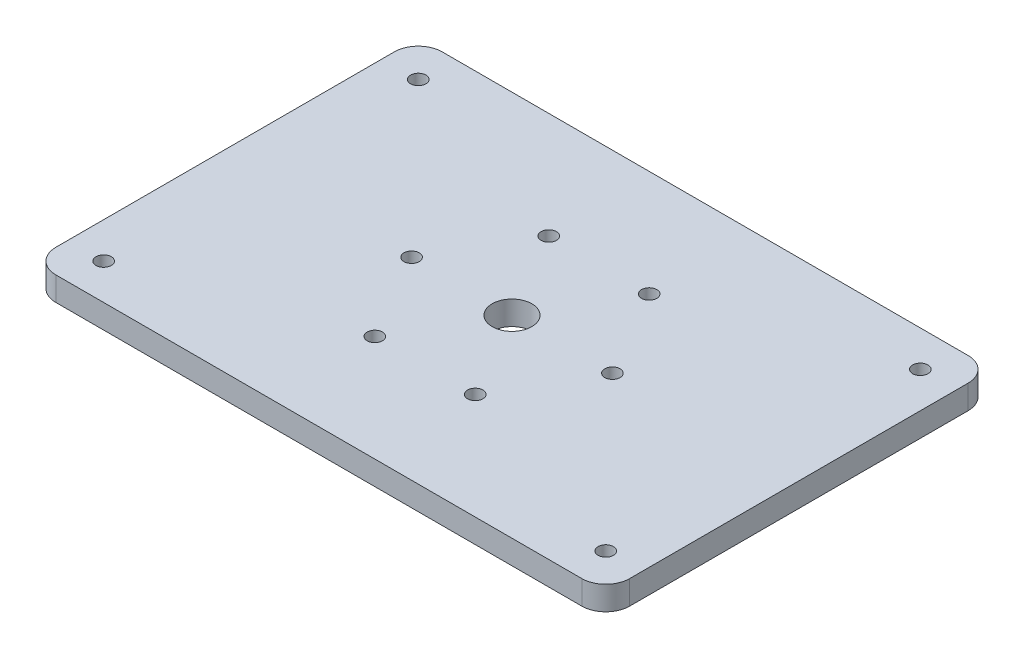
ISO-10303-21;
HEADER;
FILE_DESCRIPTION(('STEP AP214'),'2;1');
FILE_NAME('part.step','',(''),(''),'','','');
FILE_SCHEMA(('AUTOMOTIVE_DESIGN { 1 0 10303 214 1 1 1 1 }'));
ENDSEC;
DATA;
#1=APPLICATION_CONTEXT('core data for automotive mechanical design processes');
#2=APPLICATION_PROTOCOL_DEFINITION('international standard','automotive_design',2000,#1);
#3=PRODUCT_CONTEXT('',#1,'mechanical');
#4=PRODUCT('Part','Part','',(#3));
#5=PRODUCT_RELATED_PRODUCT_CATEGORY('part','',(#4));
#6=PRODUCT_DEFINITION_FORMATION('','',#4);
#7=PRODUCT_DEFINITION_CONTEXT('part definition',#1,'design');
#8=PRODUCT_DEFINITION('design','',#6,#7);
#9=PRODUCT_DEFINITION_SHAPE('','',#8);
#10=(LENGTH_UNIT() NAMED_UNIT(*) SI_UNIT(.MILLI.,.METRE.));
#11=(NAMED_UNIT(*) PLANE_ANGLE_UNIT() SI_UNIT($,.RADIAN.));
#12=(NAMED_UNIT(*) SI_UNIT($,.STERADIAN.) SOLID_ANGLE_UNIT());
#13=UNCERTAINTY_MEASURE_WITH_UNIT(LENGTH_MEASURE(1.E-05),#10,'distance_accuracy_value','');
#14=(GEOMETRIC_REPRESENTATION_CONTEXT(3) GLOBAL_UNCERTAINTY_ASSIGNED_CONTEXT((#13)) GLOBAL_UNIT_ASSIGNED_CONTEXT((#10,
#11,#12)) REPRESENTATION_CONTEXT('',''));
#15=CARTESIAN_POINT('',(0.,0.,0.));
#16=DIRECTION('',(0.,0.,1.));
#17=DIRECTION('',(1.,0.,0.));
#18=AXIS2_PLACEMENT_3D('',#15,#16,#17);
#19=CARTESIAN_POINT('',(0.,5.,0.));
#20=DIRECTION('',(0.,-1.,0.));
#21=DIRECTION('',(0.,0.,-1.));
#22=AXIS2_PLACEMENT_3D('',#19,#20,#21);
#23=PLANE('',#22);
#24=CARTESIAN_POINT('',(7.50000000000001,5.,-7.50000000000001));
#25=DIRECTION('',(0.,1.,0.));
#26=DIRECTION('',(0.,0.,1.));
#27=AXIS2_PLACEMENT_3D('',#24,#25,#26);
#28=CIRCLE('',#27,1.6);
#29=CARTESIAN_POINT('',(7.50000000000001,5.,-5.90000000000001));
#30=VERTEX_POINT('',#29);
#31=EDGE_CURVE('E225',#30,#30,#28,.T.);
#32=ORIENTED_EDGE('',*,*,#31,.F.);
#33=EDGE_LOOP('',(#32));
#34=FACE_BOUND('',#33,.T.);
#35=CARTESIAN_POINT('',(112.5,5.,-73.29));
#36=DIRECTION('',(0.,1.,0.));
#37=DIRECTION('',(0.,0.,-1.));
#38=AXIS2_PLACEMENT_3D('',#35,#36,#37);
#39=CIRCLE('',#38,1.60000000000001);
#40=CARTESIAN_POINT('',(112.5,5.,-74.89));
#41=VERTEX_POINT('',#40);
#42=EDGE_CURVE('E231',#41,#41,#39,.T.);
#43=ORIENTED_EDGE('',*,*,#42,.F.);
#44=EDGE_LOOP('',(#43));
#45=FACE_BOUND('',#44,.T.);
#46=CARTESIAN_POINT('',(112.5,5.,-7.50000000000002));
#47=DIRECTION('',(0.,1.,0.));
#48=DIRECTION('',(0.,0.,-1.));
#49=AXIS2_PLACEMENT_3D('',#46,#47,#48);
#50=CIRCLE('',#49,1.60000000000001);
#51=CARTESIAN_POINT('',(112.5,5.,-9.10000000000002));
#52=VERTEX_POINT('',#51);
#53=EDGE_CURVE('E232',#52,#52,#50,.T.);
#54=ORIENTED_EDGE('',*,*,#53,.F.);
#55=EDGE_LOOP('',(#54));
#56=FACE_BOUND('',#55,.T.);
#57=CARTESIAN_POINT('',(7.50000000000001,5.,-73.29));
#58=DIRECTION('',(0.,1.,0.));
#59=DIRECTION('',(0.,0.,1.));
#60=AXIS2_PLACEMENT_3D('',#57,#58,#59);
#61=CIRCLE('',#60,1.6);
#62=CARTESIAN_POINT('',(7.50000000000001,5.,-71.69));
#63=VERTEX_POINT('',#62);
#64=EDGE_CURVE('E222',#63,#63,#61,.T.);
#65=ORIENTED_EDGE('',*,*,#64,.F.);
#66=EDGE_LOOP('',(#65));
#67=FACE_BOUND('',#66,.T.);
#68=DIRECTION('',(0.,0.,-1.));
#69=VECTOR('',#68,1.);
#70=CARTESIAN_POINT('',(120.,5.,0.));
#71=LINE('',#70,#69);
#72=CARTESIAN_POINT('',(120.,5.,-5.));
#73=VERTEX_POINT('',#72);
#74=CARTESIAN_POINT('',(120.,5.,-75.79));
#75=VERTEX_POINT('',#74);
#76=EDGE_CURVE('E179',#73,#75,#71,.T.);
#77=ORIENTED_EDGE('',*,*,#76,.T.);
#78=CARTESIAN_POINT('',(115.,5.,-75.79));
#79=DIRECTION('',(0.,-1.,0.));
#80=DIRECTION('',(0.,0.,-1.));
#81=AXIS2_PLACEMENT_3D('',#78,#79,#80);
#82=CIRCLE('',#81,5.);
#83=CARTESIAN_POINT('',(115.,5.,-80.79));
#84=VERTEX_POINT('',#83);
#85=EDGE_CURVE('E156',#75,#84,#82,.F.);
#86=ORIENTED_EDGE('',*,*,#85,.T.);
#87=DIRECTION('',(-1.,0.,0.));
#88=VECTOR('',#87,1.);
#89=CARTESIAN_POINT('',(0.,5.,-80.79));
#90=LINE('',#89,#88);
#91=CARTESIAN_POINT('',(5.,5.,-80.79));
#92=VERTEX_POINT('',#91);
#93=EDGE_CURVE('E127',#84,#92,#90,.T.);
#94=ORIENTED_EDGE('',*,*,#93,.T.);
#95=CARTESIAN_POINT('',(5.,5.,-75.79));
#96=DIRECTION('',(0.,-1.,0.));
#97=DIRECTION('',(0.,0.,-1.));
#98=AXIS2_PLACEMENT_3D('',#95,#96,#97);
#99=CIRCLE('',#98,5.);
#100=CARTESIAN_POINT('',(0.,5.,-75.79));
#101=VERTEX_POINT('',#100);
#102=EDGE_CURVE('E151',#92,#101,#99,.F.);
#103=ORIENTED_EDGE('',*,*,#102,.T.);
#104=DIRECTION('',(0.,0.,1.));
#105=VECTOR('',#104,1.);
#106=CARTESIAN_POINT('',(0.,5.,0.));
#107=LINE('',#106,#105);
#108=CARTESIAN_POINT('',(0.,5.,-5.));
#109=VERTEX_POINT('',#108);
#110=EDGE_CURVE('E134',#101,#109,#107,.T.);
#111=ORIENTED_EDGE('',*,*,#110,.T.);
#112=CARTESIAN_POINT('',(5.,5.,-5.));
#113=DIRECTION('',(0.,-1.,0.));
#114=DIRECTION('',(0.,0.,-1.));
#115=AXIS2_PLACEMENT_3D('',#112,#113,#114);
#116=CIRCLE('',#115,5.);
#117=CARTESIAN_POINT('',(5.,5.,0.));
#118=VERTEX_POINT('',#117);
#119=EDGE_CURVE('E63',#109,#118,#116,.F.);
#120=ORIENTED_EDGE('',*,*,#119,.T.);
#121=DIRECTION('',(1.,0.,0.));
#122=VECTOR('',#121,1.);
#123=CARTESIAN_POINT('',(0.,5.,0.));
#124=LINE('',#123,#122);
#125=CARTESIAN_POINT('',(115.,5.,0.));
#126=VERTEX_POINT('',#125);
#127=EDGE_CURVE('E137',#118,#126,#124,.T.);
#128=ORIENTED_EDGE('',*,*,#127,.T.);
#129=CARTESIAN_POINT('',(115.,5.,-5.));
#130=DIRECTION('',(0.,-1.,0.));
#131=DIRECTION('',(0.,0.,-1.));
#132=AXIS2_PLACEMENT_3D('',#129,#130,#131);
#133=CIRCLE('',#132,5.);
#134=EDGE_CURVE('E154',#126,#73,#133,.F.);
#135=ORIENTED_EDGE('',*,*,#134,.T.);
#136=EDGE_LOOP('',(#77,#86,#94,#103,#111,#120,#128,#135));
#137=FACE_BOUND('',#136,.T.);
#138=CARTESIAN_POINT('',(39.,5.,-40.395));
#139=DIRECTION('',(0.,1.,0.));
#140=DIRECTION('',(0.,0.,1.));
#141=AXIS2_PLACEMENT_3D('',#138,#139,#140);
#142=CIRCLE('',#141,1.6);
#143=CARTESIAN_POINT('',(39.,5.,-38.795));
#144=VERTEX_POINT('',#143);
#145=EDGE_CURVE('E172',#144,#144,#142,.T.);
#146=ORIENTED_EDGE('',*,*,#145,.F.);
#147=EDGE_LOOP('',(#146));
#148=FACE_BOUND('',#147,.T.);
#149=CARTESIAN_POINT('',(60.,5.,-40.395));
#150=DIRECTION('',(0.,1.,0.));
#151=DIRECTION('',(0.,0.,1.));
#152=AXIS2_PLACEMENT_3D('',#149,#150,#151);
#153=CIRCLE('',#152,4.15);
#154=CARTESIAN_POINT('',(60.,5.,-36.245));
#155=VERTEX_POINT('',#154);
#156=EDGE_CURVE('E184',#155,#155,#153,.T.);
#157=ORIENTED_EDGE('',*,*,#156,.F.);
#158=EDGE_LOOP('',(#157));
#159=FACE_BOUND('',#158,.T.);
#160=CARTESIAN_POINT('',(49.5,5.,-58.5815334794732));
#161=DIRECTION('',(0.,1.,0.));
#162=DIRECTION('',(0.,0.,1.));
#163=AXIS2_PLACEMENT_3D('',#160,#161,#162);
#164=CIRCLE('',#163,1.60000000000002);
#165=CARTESIAN_POINT('',(49.5,5.,-56.9815334794732));
#166=VERTEX_POINT('',#165);
#167=EDGE_CURVE('E189',#166,#166,#164,.T.);
#168=ORIENTED_EDGE('',*,*,#167,.F.);
#169=EDGE_LOOP('',(#168));
#170=FACE_BOUND('',#169,.T.);
#171=CARTESIAN_POINT('',(70.5,5.,-58.5815334794732));
#172=DIRECTION('',(0.,1.,0.));
#173=DIRECTION('',(0.,0.,1.));
#174=AXIS2_PLACEMENT_3D('',#171,#172,#173);
#175=CIRCLE('',#174,1.59999999999999);
#176=CARTESIAN_POINT('',(70.5,5.,-56.9815334794732));
#177=VERTEX_POINT('',#176);
#178=EDGE_CURVE('E195',#177,#177,#175,.T.);
#179=ORIENTED_EDGE('',*,*,#178,.F.);
#180=EDGE_LOOP('',(#179));
#181=FACE_BOUND('',#180,.T.);
#182=CARTESIAN_POINT('',(81.,5.,-40.395));
#183=DIRECTION('',(0.,1.,0.));
#184=DIRECTION('',(0.,0.,1.));
#185=AXIS2_PLACEMENT_3D('',#182,#183,#184);
#186=CIRCLE('',#185,1.59999999999999);
#187=CARTESIAN_POINT('',(81.,5.,-38.795));
#188=VERTEX_POINT('',#187);
#189=EDGE_CURVE('E201',#188,#188,#186,.T.);
#190=ORIENTED_EDGE('',*,*,#189,.F.);
#191=EDGE_LOOP('',(#190));
#192=FACE_BOUND('',#191,.T.);
#193=CARTESIAN_POINT('',(70.5,5.,-22.2084665205268));
#194=DIRECTION('',(0.,1.,0.));
#195=DIRECTION('',(0.,0.,1.));
#196=AXIS2_PLACEMENT_3D('',#193,#194,#195);
#197=CIRCLE('',#196,1.59999999999999);
#198=CARTESIAN_POINT('',(70.5,5.,-20.6084665205268));
#199=VERTEX_POINT('',#198);
#200=EDGE_CURVE('E207',#199,#199,#197,.T.);
#201=ORIENTED_EDGE('',*,*,#200,.F.);
#202=EDGE_LOOP('',(#201));
#203=FACE_BOUND('',#202,.T.);
#204=CARTESIAN_POINT('',(49.5,5.,-22.2084665205268));
#205=DIRECTION('',(0.,1.,0.));
#206=DIRECTION('',(0.,0.,1.));
#207=AXIS2_PLACEMENT_3D('',#204,#205,#206);
#208=CIRCLE('',#207,1.6);
#209=CARTESIAN_POINT('',(49.5,5.,-20.6084665205268));
#210=VERTEX_POINT('',#209);
#211=EDGE_CURVE('E213',#210,#210,#208,.T.);
#212=ORIENTED_EDGE('',*,*,#211,.F.);
#213=EDGE_LOOP('',(#212));
#214=FACE_BOUND('',#213,.T.);
#215=ADVANCED_FACE('F41',(#34,#45,#56,#67,#137,#148,#159,#170,#181,#192,#203,#214),#23,.F.);
#216=CARTESIAN_POINT('',(0.,0.,0.));
#217=DIRECTION('',(0.,-1.,0.));
#218=DIRECTION('',(0.,0.,-1.));
#219=AXIS2_PLACEMENT_3D('',#216,#217,#218);
#220=PLANE('',#219);
#221=CARTESIAN_POINT('',(7.50000000000001,0.,-7.50000000000001));
#222=DIRECTION('',(0.,1.,0.));
#223=DIRECTION('',(0.,0.,1.));
#224=AXIS2_PLACEMENT_3D('',#221,#222,#223);
#225=CIRCLE('',#224,1.6);
#226=CARTESIAN_POINT('',(7.50000000000001,0.,-5.90000000000001));
#227=VERTEX_POINT('',#226);
#228=EDGE_CURVE('E235',#227,#227,#225,.T.);
#229=ORIENTED_EDGE('',*,*,#228,.T.);
#230=EDGE_LOOP('',(#229));
#231=FACE_BOUND('',#230,.T.);
#232=CARTESIAN_POINT('',(112.5,0.,-73.29));
#233=DIRECTION('',(0.,1.,0.));
#234=DIRECTION('',(0.,0.,-1.));
#235=AXIS2_PLACEMENT_3D('',#232,#233,#234);
#236=CIRCLE('',#235,1.60000000000001);
#237=CARTESIAN_POINT('',(112.5,0.,-74.89));
#238=VERTEX_POINT('',#237);
#239=EDGE_CURVE('E228',#238,#238,#236,.T.);
#240=ORIENTED_EDGE('',*,*,#239,.T.);
#241=EDGE_LOOP('',(#240));
#242=FACE_BOUND('',#241,.T.);
#243=CARTESIAN_POINT('',(112.5,0.,-7.50000000000002));
#244=DIRECTION('',(0.,1.,0.));
#245=DIRECTION('',(0.,0.,-1.));
#246=AXIS2_PLACEMENT_3D('',#243,#244,#245);
#247=CIRCLE('',#246,1.60000000000001);
#248=CARTESIAN_POINT('',(112.5,0.,-9.10000000000002));
#249=VERTEX_POINT('',#248);
#250=EDGE_CURVE('E240',#249,#249,#247,.T.);
#251=ORIENTED_EDGE('',*,*,#250,.T.);
#252=EDGE_LOOP('',(#251));
#253=FACE_BOUND('',#252,.T.);
#254=CARTESIAN_POINT('',(7.50000000000001,0.,-73.29));
#255=DIRECTION('',(0.,1.,0.));
#256=DIRECTION('',(0.,0.,1.));
#257=AXIS2_PLACEMENT_3D('',#254,#255,#256);
#258=CIRCLE('',#257,1.6);
#259=CARTESIAN_POINT('',(7.50000000000001,0.,-71.69));
#260=VERTEX_POINT('',#259);
#261=EDGE_CURVE('E219',#260,#260,#258,.T.);
#262=ORIENTED_EDGE('',*,*,#261,.T.);
#263=EDGE_LOOP('',(#262));
#264=FACE_BOUND('',#263,.T.);
#265=CARTESIAN_POINT('',(70.5,0.,-22.2084665205268));
#266=DIRECTION('',(0.,1.,0.));
#267=DIRECTION('',(0.,0.,1.));
#268=AXIS2_PLACEMENT_3D('',#265,#266,#267);
#269=CIRCLE('',#268,1.59999999999999);
#270=CARTESIAN_POINT('',(70.5,0.,-20.6084665205268));
#271=VERTEX_POINT('',#270);
#272=EDGE_CURVE('E210',#271,#271,#269,.T.);
#273=ORIENTED_EDGE('',*,*,#272,.T.);
#274=EDGE_LOOP('',(#273));
#275=FACE_BOUND('',#274,.T.);
#276=CARTESIAN_POINT('',(70.5,0.,-58.5815334794732));
#277=DIRECTION('',(0.,1.,0.));
#278=DIRECTION('',(0.,0.,1.));
#279=AXIS2_PLACEMENT_3D('',#276,#277,#278);
#280=CIRCLE('',#279,1.59999999999999);
#281=CARTESIAN_POINT('',(70.5,0.,-56.9815334794732));
#282=VERTEX_POINT('',#281);
#283=EDGE_CURVE('E198',#282,#282,#280,.T.);
#284=ORIENTED_EDGE('',*,*,#283,.T.);
#285=EDGE_LOOP('',(#284));
#286=FACE_BOUND('',#285,.T.);
#287=CARTESIAN_POINT('',(60.,0.,-40.395));
#288=DIRECTION('',(0.,1.,0.));
#289=DIRECTION('',(0.,0.,1.));
#290=AXIS2_PLACEMENT_3D('',#287,#288,#289);
#291=CIRCLE('',#290,4.15);
#292=CARTESIAN_POINT('',(60.,0.,-36.245));
#293=VERTEX_POINT('',#292);
#294=EDGE_CURVE('E186',#293,#293,#291,.T.);
#295=ORIENTED_EDGE('',*,*,#294,.T.);
#296=EDGE_LOOP('',(#295));
#297=FACE_BOUND('',#296,.T.);
#298=DIRECTION('',(-1.,0.,0.));
#299=VECTOR('',#298,1.);
#300=CARTESIAN_POINT('',(0.,0.,-80.79));
#301=LINE('',#300,#299);
#302=CARTESIAN_POINT('',(115.,0.,-80.79));
#303=VERTEX_POINT('',#302);
#304=CARTESIAN_POINT('',(5.,0.,-80.79));
#305=VERTEX_POINT('',#304);
#306=EDGE_CURVE('E124',#303,#305,#301,.T.);
#307=ORIENTED_EDGE('',*,*,#306,.F.);
#308=CARTESIAN_POINT('',(115.,0.,-75.79));
#309=DIRECTION('',(0.,-1.,0.));
#310=DIRECTION('',(0.,0.,-1.));
#311=AXIS2_PLACEMENT_3D('',#308,#309,#310);
#312=CIRCLE('',#311,5.);
#313=CARTESIAN_POINT('',(120.,0.,-75.79));
#314=VERTEX_POINT('',#313);
#315=EDGE_CURVE('E107',#303,#314,#312,.T.);
#316=ORIENTED_EDGE('',*,*,#315,.T.);
#317=DIRECTION('',(0.,0.,-1.));
#318=VECTOR('',#317,1.);
#319=CARTESIAN_POINT('',(120.,0.,0.));
#320=LINE('',#319,#318);
#321=CARTESIAN_POINT('',(120.,0.,-5.));
#322=VERTEX_POINT('',#321);
#323=EDGE_CURVE('E135',#322,#314,#320,.T.);
#324=ORIENTED_EDGE('',*,*,#323,.F.);
#325=CARTESIAN_POINT('',(115.,0.,-5.));
#326=DIRECTION('',(0.,-1.,0.));
#327=DIRECTION('',(0.,0.,-1.));
#328=AXIS2_PLACEMENT_3D('',#325,#326,#327);
#329=CIRCLE('',#328,5.);
#330=CARTESIAN_POINT('',(115.,0.,0.));
#331=VERTEX_POINT('',#330);
#332=EDGE_CURVE('E118',#322,#331,#329,.T.);
#333=ORIENTED_EDGE('',*,*,#332,.T.);
#334=DIRECTION('',(1.,0.,0.));
#335=VECTOR('',#334,1.);
#336=CARTESIAN_POINT('',(0.,0.,0.));
#337=LINE('',#336,#335);
#338=CARTESIAN_POINT('',(5.,0.,0.));
#339=VERTEX_POINT('',#338);
#340=EDGE_CURVE('E139',#339,#331,#337,.T.);
#341=ORIENTED_EDGE('',*,*,#340,.F.);
#342=CARTESIAN_POINT('',(5.,0.,-5.));
#343=DIRECTION('',(0.,-1.,0.));
#344=DIRECTION('',(0.,0.,-1.));
#345=AXIS2_PLACEMENT_3D('',#342,#343,#344);
#346=CIRCLE('',#345,5.);
#347=CARTESIAN_POINT('',(0.,0.,-5.));
#348=VERTEX_POINT('',#347);
#349=EDGE_CURVE('E145',#339,#348,#346,.T.);
#350=ORIENTED_EDGE('',*,*,#349,.T.);
#351=DIRECTION('',(0.,0.,1.));
#352=VECTOR('',#351,1.);
#353=CARTESIAN_POINT('',(0.,0.,0.));
#354=LINE('',#353,#352);
#355=CARTESIAN_POINT('',(0.,0.,-75.79));
#356=VERTEX_POINT('',#355);
#357=EDGE_CURVE('E167',#356,#348,#354,.T.);
#358=ORIENTED_EDGE('',*,*,#357,.F.);
#359=CARTESIAN_POINT('',(5.,0.,-75.79));
#360=DIRECTION('',(0.,-1.,0.));
#361=DIRECTION('',(0.,0.,-1.));
#362=AXIS2_PLACEMENT_3D('',#359,#360,#361);
#363=CIRCLE('',#362,5.);
#364=EDGE_CURVE('E128',#356,#305,#363,.T.);
#365=ORIENTED_EDGE('',*,*,#364,.T.);
#366=EDGE_LOOP('',(#307,#316,#324,#333,#341,#350,#358,#365));
#367=FACE_BOUND('',#366,.T.);
#368=CARTESIAN_POINT('',(39.,0.,-40.395));
#369=DIRECTION('',(0.,1.,0.));
#370=DIRECTION('',(0.,0.,1.));
#371=AXIS2_PLACEMENT_3D('',#368,#369,#370);
#372=CIRCLE('',#371,1.6);
#373=CARTESIAN_POINT('',(39.,0.,-38.795));
#374=VERTEX_POINT('',#373);
#375=EDGE_CURVE('E175',#374,#374,#372,.T.);
#376=ORIENTED_EDGE('',*,*,#375,.T.);
#377=EDGE_LOOP('',(#376));
#378=FACE_BOUND('',#377,.T.);
#379=CARTESIAN_POINT('',(49.5,0.,-58.5815334794732));
#380=DIRECTION('',(0.,1.,0.));
#381=DIRECTION('',(0.,0.,1.));
#382=AXIS2_PLACEMENT_3D('',#379,#380,#381);
#383=CIRCLE('',#382,1.60000000000002);
#384=CARTESIAN_POINT('',(49.5,0.,-56.9815334794732));
#385=VERTEX_POINT('',#384);
#386=EDGE_CURVE('E192',#385,#385,#383,.T.);
#387=ORIENTED_EDGE('',*,*,#386,.T.);
#388=EDGE_LOOP('',(#387));
#389=FACE_BOUND('',#388,.T.);
#390=CARTESIAN_POINT('',(81.,0.,-40.395));
#391=DIRECTION('',(0.,1.,0.));
#392=DIRECTION('',(0.,0.,1.));
#393=AXIS2_PLACEMENT_3D('',#390,#391,#392);
#394=CIRCLE('',#393,1.59999999999999);
#395=CARTESIAN_POINT('',(81.,0.,-38.795));
#396=VERTEX_POINT('',#395);
#397=EDGE_CURVE('E204',#396,#396,#394,.T.);
#398=ORIENTED_EDGE('',*,*,#397,.T.);
#399=EDGE_LOOP('',(#398));
#400=FACE_BOUND('',#399,.T.);
#401=CARTESIAN_POINT('',(49.5,0.,-22.2084665205268));
#402=DIRECTION('',(0.,1.,0.));
#403=DIRECTION('',(0.,0.,1.));
#404=AXIS2_PLACEMENT_3D('',#401,#402,#403);
#405=CIRCLE('',#404,1.6);
#406=CARTESIAN_POINT('',(49.5,0.,-20.6084665205268));
#407=VERTEX_POINT('',#406);
#408=EDGE_CURVE('E216',#407,#407,#405,.T.);
#409=ORIENTED_EDGE('',*,*,#408,.T.);
#410=EDGE_LOOP('',(#409));
#411=FACE_BOUND('',#410,.T.);
#412=ADVANCED_FACE('F131',(#231,#242,#253,#264,#275,#286,#297,#367,#378,#389,#400,#411),#220,.T.);
#413=CARTESIAN_POINT('',(0.,5.,0.));
#414=DIRECTION('',(1.,0.,0.));
#415=DIRECTION('',(0.,0.,-1.));
#416=AXIS2_PLACEMENT_3D('',#413,#414,#415);
#417=PLANE('',#416);
#418=ORIENTED_EDGE('',*,*,#357,.T.);
#419=DIRECTION('',(0.,-1.,0.));
#420=VECTOR('',#419,1.);
#421=CARTESIAN_POINT('',(0.,5.,-5.));
#422=LINE('',#421,#420);
#423=EDGE_CURVE('E11',#348,#109,#422,.F.);
#424=ORIENTED_EDGE('',*,*,#423,.T.);
#425=ORIENTED_EDGE('',*,*,#110,.F.);
#426=DIRECTION('',(0.,-1.,0.));
#427=VECTOR('',#426,1.);
#428=CARTESIAN_POINT('',(0.,5.,-75.79));
#429=LINE('',#428,#427);
#430=EDGE_CURVE('E49',#101,#356,#429,.T.);
#431=ORIENTED_EDGE('',*,*,#430,.T.);
#432=EDGE_LOOP('',(#418,#424,#425,#431));
#433=FACE_BOUND('',#432,.T.);
#434=ADVANCED_FACE('F166',(#433),#417,.F.);
#435=CARTESIAN_POINT('',(0.,5.,0.));
#436=DIRECTION('',(0.,0.,-1.));
#437=DIRECTION('',(-1.,0.,0.));
#438=AXIS2_PLACEMENT_3D('',#435,#436,#437);
#439=PLANE('',#438);
#440=ORIENTED_EDGE('',*,*,#340,.T.);
#441=DIRECTION('',(0.,-1.,0.));
#442=VECTOR('',#441,1.);
#443=CARTESIAN_POINT('',(115.,5.,0.));
#444=LINE('',#443,#442);
#445=EDGE_CURVE('E56',#331,#126,#444,.F.);
#446=ORIENTED_EDGE('',*,*,#445,.T.);
#447=ORIENTED_EDGE('',*,*,#127,.F.);
#448=DIRECTION('',(0.,-1.,0.));
#449=VECTOR('',#448,1.);
#450=CARTESIAN_POINT('',(5.,5.,0.));
#451=LINE('',#450,#449);
#452=EDGE_CURVE('E158',#118,#339,#451,.T.);
#453=ORIENTED_EDGE('',*,*,#452,.T.);
#454=EDGE_LOOP('',(#440,#446,#447,#453));
#455=FACE_BOUND('',#454,.T.);
#456=ADVANCED_FACE('F283',(#455),#439,.F.);
#457=CARTESIAN_POINT('',(120.,5.,0.));
#458=DIRECTION('',(-1.,0.,0.));
#459=DIRECTION('',(0.,0.,1.));
#460=AXIS2_PLACEMENT_3D('',#457,#458,#459);
#461=PLANE('',#460);
#462=ORIENTED_EDGE('',*,*,#323,.T.);
#463=DIRECTION('',(0.,-1.,0.));
#464=VECTOR('',#463,1.);
#465=CARTESIAN_POINT('',(120.,5.,-75.79));
#466=LINE('',#465,#464);
#467=EDGE_CURVE('E112',#314,#75,#466,.F.);
#468=ORIENTED_EDGE('',*,*,#467,.T.);
#469=ORIENTED_EDGE('',*,*,#76,.F.);
#470=DIRECTION('',(0.,-1.,0.));
#471=VECTOR('',#470,1.);
#472=CARTESIAN_POINT('',(120.,5.,-5.));
#473=LINE('',#472,#471);
#474=EDGE_CURVE('E117',#73,#322,#473,.T.);
#475=ORIENTED_EDGE('',*,*,#474,.T.);
#476=EDGE_LOOP('',(#462,#468,#469,#475));
#477=FACE_BOUND('',#476,.T.);
#478=ADVANCED_FACE('F291',(#477),#461,.F.);
#479=CARTESIAN_POINT('',(0.,5.,-80.79));
#480=DIRECTION('',(0.,0.,1.));
#481=DIRECTION('',(1.,0.,0.));
#482=AXIS2_PLACEMENT_3D('',#479,#480,#481);
#483=PLANE('',#482);
#484=ORIENTED_EDGE('',*,*,#93,.F.);
#485=DIRECTION('',(0.,-1.,0.));
#486=VECTOR('',#485,1.);
#487=CARTESIAN_POINT('',(115.,5.,-80.79));
#488=LINE('',#487,#486);
#489=EDGE_CURVE('E111',#84,#303,#488,.T.);
#490=ORIENTED_EDGE('',*,*,#489,.T.);
#491=ORIENTED_EDGE('',*,*,#306,.T.);
#492=DIRECTION('',(0.,-1.,0.));
#493=VECTOR('',#492,1.);
#494=CARTESIAN_POINT('',(5.,5.,-80.79));
#495=LINE('',#494,#493);
#496=EDGE_CURVE('E129',#305,#92,#495,.F.);
#497=ORIENTED_EDGE('',*,*,#496,.T.);
#498=EDGE_LOOP('',(#484,#490,#491,#497));
#499=FACE_BOUND('',#498,.T.);
#500=ADVANCED_FACE('F123',(#499),#483,.F.);
#501=CARTESIAN_POINT('',(39.,5.,-40.395));
#502=DIRECTION('',(0.,-1.,0.));
#503=DIRECTION('',(0.,0.,-1.));
#504=AXIS2_PLACEMENT_3D('',#501,#502,#503);
#505=CYLINDRICAL_SURFACE('',#504,1.6);
#506=ORIENTED_EDGE('',*,*,#145,.T.);
#507=EDGE_LOOP('',(#506));
#508=FACE_BOUND('',#507,.T.);
#509=ORIENTED_EDGE('',*,*,#375,.F.);
#510=EDGE_LOOP('',(#509));
#511=FACE_BOUND('',#510,.T.);
#512=ADVANCED_FACE('F290',(#508,#511),#505,.F.);
#513=CARTESIAN_POINT('',(60.,5.,-40.395));
#514=DIRECTION('',(0.,-1.,0.));
#515=DIRECTION('',(0.,0.,-1.));
#516=AXIS2_PLACEMENT_3D('',#513,#514,#515);
#517=CYLINDRICAL_SURFACE('',#516,4.15);
#518=ORIENTED_EDGE('',*,*,#156,.T.);
#519=EDGE_LOOP('',(#518));
#520=FACE_BOUND('',#519,.T.);
#521=ORIENTED_EDGE('',*,*,#294,.F.);
#522=EDGE_LOOP('',(#521));
#523=FACE_BOUND('',#522,.T.);
#524=ADVANCED_FACE('F413',(#520,#523),#517,.F.);
#525=CARTESIAN_POINT('',(49.5,5.,-58.5815334794732));
#526=DIRECTION('',(0.,-1.,0.));
#527=DIRECTION('',(0.,0.,-1.));
#528=AXIS2_PLACEMENT_3D('',#525,#526,#527);
#529=CYLINDRICAL_SURFACE('',#528,1.60000000000002);
#530=ORIENTED_EDGE('',*,*,#167,.T.);
#531=EDGE_LOOP('',(#530));
#532=FACE_BOUND('',#531,.T.);
#533=ORIENTED_EDGE('',*,*,#386,.F.);
#534=EDGE_LOOP('',(#533));
#535=FACE_BOUND('',#534,.T.);
#536=ADVANCED_FACE('F403',(#532,#535),#529,.F.);
#537=CARTESIAN_POINT('',(70.5,5.,-58.5815334794732));
#538=DIRECTION('',(0.,-1.,0.));
#539=DIRECTION('',(0.,0.,-1.));
#540=AXIS2_PLACEMENT_3D('',#537,#538,#539);
#541=CYLINDRICAL_SURFACE('',#540,1.59999999999999);
#542=ORIENTED_EDGE('',*,*,#178,.T.);
#543=EDGE_LOOP('',(#542));
#544=FACE_BOUND('',#543,.T.);
#545=ORIENTED_EDGE('',*,*,#283,.F.);
#546=EDGE_LOOP('',(#545));
#547=FACE_BOUND('',#546,.T.);
#548=ADVANCED_FACE('F393',(#544,#547),#541,.F.);
#549=CARTESIAN_POINT('',(81.,5.,-40.395));
#550=DIRECTION('',(0.,-1.,0.));
#551=DIRECTION('',(0.,0.,-1.));
#552=AXIS2_PLACEMENT_3D('',#549,#550,#551);
#553=CYLINDRICAL_SURFACE('',#552,1.59999999999999);
#554=ORIENTED_EDGE('',*,*,#189,.T.);
#555=EDGE_LOOP('',(#554));
#556=FACE_BOUND('',#555,.T.);
#557=ORIENTED_EDGE('',*,*,#397,.F.);
#558=EDGE_LOOP('',(#557));
#559=FACE_BOUND('',#558,.T.);
#560=ADVANCED_FACE('F383',(#556,#559),#553,.F.);
#561=CARTESIAN_POINT('',(70.5,5.,-22.2084665205268));
#562=DIRECTION('',(0.,-1.,0.));
#563=DIRECTION('',(0.,0.,-1.));
#564=AXIS2_PLACEMENT_3D('',#561,#562,#563);
#565=CYLINDRICAL_SURFACE('',#564,1.59999999999999);
#566=ORIENTED_EDGE('',*,*,#200,.T.);
#567=EDGE_LOOP('',(#566));
#568=FACE_BOUND('',#567,.T.);
#569=ORIENTED_EDGE('',*,*,#272,.F.);
#570=EDGE_LOOP('',(#569));
#571=FACE_BOUND('',#570,.T.);
#572=ADVANCED_FACE('F273',(#568,#571),#565,.F.);
#573=CARTESIAN_POINT('',(49.5,5.,-22.2084665205268));
#574=DIRECTION('',(0.,-1.,0.));
#575=DIRECTION('',(0.,0.,-1.));
#576=AXIS2_PLACEMENT_3D('',#573,#574,#575);
#577=CYLINDRICAL_SURFACE('',#576,1.6);
#578=ORIENTED_EDGE('',*,*,#211,.T.);
#579=EDGE_LOOP('',(#578));
#580=FACE_BOUND('',#579,.T.);
#581=ORIENTED_EDGE('',*,*,#408,.F.);
#582=EDGE_LOOP('',(#581));
#583=FACE_BOUND('',#582,.T.);
#584=ADVANCED_FACE('F269',(#580,#583),#577,.F.);
#585=CARTESIAN_POINT('',(7.50000000000001,0.,-73.29));
#586=DIRECTION('',(0.,1.,0.));
#587=DIRECTION('',(0.,0.,1.));
#588=AXIS2_PLACEMENT_3D('',#585,#586,#587);
#589=CYLINDRICAL_SURFACE('',#588,1.6);
#590=ORIENTED_EDGE('',*,*,#261,.F.);
#591=EDGE_LOOP('',(#590));
#592=FACE_BOUND('',#591,.T.);
#593=ORIENTED_EDGE('',*,*,#64,.T.);
#594=EDGE_LOOP('',(#593));
#595=FACE_BOUND('',#594,.T.);
#596=ADVANCED_FACE('F272',(#592,#595),#589,.F.);
#597=CARTESIAN_POINT('',(112.5,0.,-7.50000000000002));
#598=DIRECTION('',(0.,1.,0.));
#599=DIRECTION('',(0.,0.,1.));
#600=AXIS2_PLACEMENT_3D('',#597,#598,#599);
#601=CYLINDRICAL_SURFACE('',#600,1.60000000000001);
#602=ORIENTED_EDGE('',*,*,#250,.F.);
#603=EDGE_LOOP('',(#602));
#604=FACE_BOUND('',#603,.T.);
#605=ORIENTED_EDGE('',*,*,#53,.T.);
#606=EDGE_LOOP('',(#605));
#607=FACE_BOUND('',#606,.T.);
#608=ADVANCED_FACE('F246',(#604,#607),#601,.F.);
#609=CARTESIAN_POINT('',(112.5,0.,-73.29));
#610=DIRECTION('',(0.,1.,0.));
#611=DIRECTION('',(0.,0.,1.));
#612=AXIS2_PLACEMENT_3D('',#609,#610,#611);
#613=CYLINDRICAL_SURFACE('',#612,1.60000000000001);
#614=ORIENTED_EDGE('',*,*,#239,.F.);
#615=EDGE_LOOP('',(#614));
#616=FACE_BOUND('',#615,.T.);
#617=ORIENTED_EDGE('',*,*,#42,.T.);
#618=EDGE_LOOP('',(#617));
#619=FACE_BOUND('',#618,.T.);
#620=ADVANCED_FACE('F340',(#616,#619),#613,.F.);
#621=CARTESIAN_POINT('',(7.50000000000001,0.,-7.50000000000001));
#622=DIRECTION('',(0.,1.,0.));
#623=DIRECTION('',(0.,0.,1.));
#624=AXIS2_PLACEMENT_3D('',#621,#622,#623);
#625=CYLINDRICAL_SURFACE('',#624,1.6);
#626=ORIENTED_EDGE('',*,*,#228,.F.);
#627=EDGE_LOOP('',(#626));
#628=FACE_BOUND('',#627,.T.);
#629=ORIENTED_EDGE('',*,*,#31,.T.);
#630=EDGE_LOOP('',(#629));
#631=FACE_BOUND('',#630,.T.);
#632=ADVANCED_FACE('F300',(#628,#631),#625,.F.);
#633=CARTESIAN_POINT('',(115.,5.,-75.79));
#634=DIRECTION('',(0.,-1.,0.));
#635=DIRECTION('',(0.,0.,-1.));
#636=AXIS2_PLACEMENT_3D('',#633,#634,#635);
#637=CYLINDRICAL_SURFACE('',#636,5.);
#638=ORIENTED_EDGE('',*,*,#85,.F.);
#639=ORIENTED_EDGE('',*,*,#467,.F.);
#640=ORIENTED_EDGE('',*,*,#315,.F.);
#641=ORIENTED_EDGE('',*,*,#489,.F.);
#642=EDGE_LOOP('',(#638,#639,#640,#641));
#643=FACE_BOUND('',#642,.T.);
#644=ADVANCED_FACE('F110',(#643),#637,.T.);
#645=CARTESIAN_POINT('',(115.,5.,-5.));
#646=DIRECTION('',(0.,-1.,0.));
#647=DIRECTION('',(0.,0.,-1.));
#648=AXIS2_PLACEMENT_3D('',#645,#646,#647);
#649=CYLINDRICAL_SURFACE('',#648,5.);
#650=ORIENTED_EDGE('',*,*,#134,.F.);
#651=ORIENTED_EDGE('',*,*,#445,.F.);
#652=ORIENTED_EDGE('',*,*,#332,.F.);
#653=ORIENTED_EDGE('',*,*,#474,.F.);
#654=EDGE_LOOP('',(#650,#651,#652,#653));
#655=FACE_BOUND('',#654,.T.);
#656=ADVANCED_FACE('F299',(#655),#649,.T.);
#657=CARTESIAN_POINT('',(5.,5.,-5.));
#658=DIRECTION('',(0.,-1.,0.));
#659=DIRECTION('',(0.,0.,-1.));
#660=AXIS2_PLACEMENT_3D('',#657,#658,#659);
#661=CYLINDRICAL_SURFACE('',#660,5.);
#662=ORIENTED_EDGE('',*,*,#119,.F.);
#663=ORIENTED_EDGE('',*,*,#423,.F.);
#664=ORIENTED_EDGE('',*,*,#349,.F.);
#665=ORIENTED_EDGE('',*,*,#452,.F.);
#666=EDGE_LOOP('',(#662,#663,#664,#665));
#667=FACE_BOUND('',#666,.T.);
#668=ADVANCED_FACE('F302',(#667),#661,.T.);
#669=CARTESIAN_POINT('',(5.,5.,-75.79));
#670=DIRECTION('',(0.,-1.,0.));
#671=DIRECTION('',(0.,0.,-1.));
#672=AXIS2_PLACEMENT_3D('',#669,#670,#671);
#673=CYLINDRICAL_SURFACE('',#672,5.);
#674=ORIENTED_EDGE('',*,*,#102,.F.);
#675=ORIENTED_EDGE('',*,*,#496,.F.);
#676=ORIENTED_EDGE('',*,*,#364,.F.);
#677=ORIENTED_EDGE('',*,*,#430,.F.);
#678=EDGE_LOOP('',(#674,#675,#676,#677));
#679=FACE_BOUND('',#678,.T.);
#680=ADVANCED_FACE('F43',(#679),#673,.T.);
#681=CLOSED_SHELL('',(#215,#412,#434,#456,#478,#500,#512,#524,#536,#548,#560,#572,#584,#596,
#608,#620,#632,#644,#656,#668,#680));
#682=MANIFOLD_SOLID_BREP('B2',#681);
#683=ADVANCED_BREP_SHAPE_REPRESENTATION('',(#18,#682),#14);
#684=SHAPE_DEFINITION_REPRESENTATION(#9,#683);
ENDSEC;
END-ISO-10303-21;
